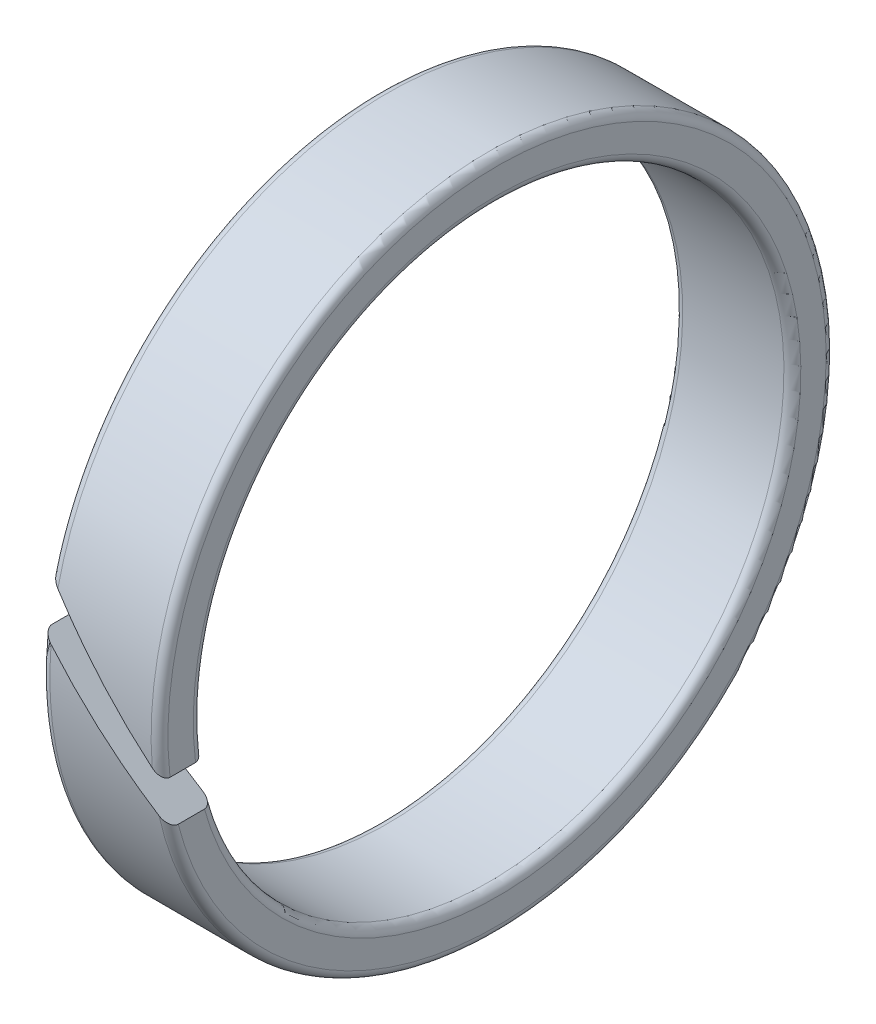
ISO-10303-21;
HEADER;
FILE_DESCRIPTION(('STEP AP214'),'2;1');
FILE_NAME('part.step','',(''),(''),'','','');
FILE_SCHEMA(('AUTOMOTIVE_DESIGN { 1 0 10303 214 1 1 1 1 }'));
ENDSEC;
DATA;
#1=APPLICATION_CONTEXT('core data for automotive mechanical design processes');
#2=APPLICATION_PROTOCOL_DEFINITION('international standard','automotive_design',2000,#1);
#3=PRODUCT_CONTEXT('',#1,'mechanical');
#4=PRODUCT('Part','Part','',(#3));
#5=PRODUCT_RELATED_PRODUCT_CATEGORY('part','',(#4));
#6=PRODUCT_DEFINITION_FORMATION('','',#4);
#7=PRODUCT_DEFINITION_CONTEXT('part definition',#1,'design');
#8=PRODUCT_DEFINITION('design','',#6,#7);
#9=PRODUCT_DEFINITION_SHAPE('','',#8);
#10=(LENGTH_UNIT() NAMED_UNIT(*) SI_UNIT(.MILLI.,.METRE.));
#11=(NAMED_UNIT(*) PLANE_ANGLE_UNIT() SI_UNIT($,.RADIAN.));
#12=(NAMED_UNIT(*) SI_UNIT($,.STERADIAN.) SOLID_ANGLE_UNIT());
#13=UNCERTAINTY_MEASURE_WITH_UNIT(LENGTH_MEASURE(1.E-05),#10,'distance_accuracy_value','');
#14=(GEOMETRIC_REPRESENTATION_CONTEXT(3) GLOBAL_UNCERTAINTY_ASSIGNED_CONTEXT((#13)) GLOBAL_UNIT_ASSIGNED_CONTEXT((#10,
#11,#12)) REPRESENTATION_CONTEXT('',''));
#15=CARTESIAN_POINT('',(0.,0.,0.));
#16=DIRECTION('',(0.,0.,1.));
#17=DIRECTION('',(1.,0.,0.));
#18=AXIS2_PLACEMENT_3D('',#15,#16,#17);
#19=CARTESIAN_POINT('',(-2.8,16.,0.));
#20=DIRECTION('',(1.,0.,0.));
#21=DIRECTION('',(0.,0.,-1.));
#22=AXIS2_PLACEMENT_3D('',#19,#20,#21);
#23=PLANE('',#22);
#24=DIRECTION('',(0.,0.,-1.));
#25=VECTOR('',#24,1.);
#26=CARTESIAN_POINT('',(-2.8,3.86066017177978,16.));
#27=LINE('',#26,#25);
#28=CARTESIAN_POINT('',(-2.8,3.86066017177978,15.1147379414277));
#29=VERTEX_POINT('',#28);
#30=CARTESIAN_POINT('',(-2.8,3.86066017177978,13.8728260652988));
#31=VERTEX_POINT('',#30);
#32=EDGE_CURVE('E107',#29,#31,#27,.T.);
#33=ORIENTED_EDGE('',*,*,#32,.F.);
#34=CARTESIAN_POINT('',(-2.8,0.,0.));
#35=DIRECTION('',(1.,0.,0.));
#36=DIRECTION('',(0.,0.,-1.));
#37=AXIS2_PLACEMENT_3D('',#34,#35,#36);
#38=CIRCLE('',#37,15.6);
#39=CARTESIAN_POINT('',(-2.8,1.73933982822015,15.5027319193092));
#40=VERTEX_POINT('',#39);
#41=EDGE_CURVE('E120',#29,#40,#38,.F.);
#42=ORIENTED_EDGE('',*,*,#41,.T.);
#43=DIRECTION('',(0.,0.,1.));
#44=VECTOR('',#43,1.);
#45=CARTESIAN_POINT('',(-2.8,1.73933982822015,0.));
#46=LINE('',#45,#44);
#47=CARTESIAN_POINT('',(-2.8,1.73933982822015,14.2945687924459));
#48=VERTEX_POINT('',#47);
#49=EDGE_CURVE('E124',#48,#40,#46,.T.);
#50=ORIENTED_EDGE('',*,*,#49,.F.);
#51=CARTESIAN_POINT('',(-2.8,0.,0.));
#52=DIRECTION('',(1.,0.,0.));
#53=DIRECTION('',(0.,0.,-1.));
#54=AXIS2_PLACEMENT_3D('',#51,#52,#53);
#55=CIRCLE('',#54,14.4);
#56=EDGE_CURVE('E123',#48,#31,#55,.T.);
#57=ORIENTED_EDGE('',*,*,#56,.T.);
#58=EDGE_LOOP('',(#33,#42,#50,#57));
#59=FACE_BOUND('',#58,.T.);
#60=ADVANCED_FACE('F36',(#59),#23,.F.);
#61=CARTESIAN_POINT('',(0.,0.,0.));
#62=DIRECTION('',(-1.,0.,0.));
#63=DIRECTION('',(0.,0.,1.));
#64=AXIS2_PLACEMENT_3D('',#61,#62,#63);
#65=CYLINDRICAL_SURFACE('',#64,14.);
#66=CARTESIAN_POINT('',(1.06066017177983,0.,0.));
#67=DIRECTION('',(-0.707106781186543,-0.707106781186552,0.));
#68=DIRECTION('',(-0.707106781186552,0.707106781186543,0.));
#69=AXIS2_PLACEMENT_3D('',#66,#67,#68);
#70=ELLIPSE('',#69,19.7989898732234,14.);
#71=CARTESIAN_POINT('',(-2.4,3.46066017177979,13.5655383665912));
#72=VERTEX_POINT('',#71);
#73=CARTESIAN_POINT('',(2.4,-1.33933982822016,13.9357873413935));
#74=VERTEX_POINT('',#73);
#75=EDGE_CURVE('E203',#72,#74,#70,.F.);
#76=ORIENTED_EDGE('',*,*,#75,.F.);
#77=CARTESIAN_POINT('',(-2.4,0.,0.));
#78=DIRECTION('',(1.,0.,0.));
#79=DIRECTION('',(0.,0.,-1.));
#80=AXIS2_PLACEMENT_3D('',#77,#78,#79);
#81=CIRCLE('',#80,14.);
#82=CARTESIAN_POINT('',(-2.4,1.33933982822016,13.9357873413935));
#83=VERTEX_POINT('',#82);
#84=EDGE_CURVE('E11',#72,#83,#81,.F.);
#85=ORIENTED_EDGE('',*,*,#84,.T.);
#86=CARTESIAN_POINT('',(-1.06066017177983,0.,0.));
#87=DIRECTION('',(0.707106781186543,0.707106781186552,0.));
#88=DIRECTION('',(-0.707106781186552,0.707106781186543,0.));
#89=AXIS2_PLACEMENT_3D('',#86,#87,#88);
#90=ELLIPSE('',#89,19.7989898732234,14.);
#91=CARTESIAN_POINT('',(2.4,-3.46066017177979,13.5655383665912));
#92=VERTEX_POINT('',#91);
#93=EDGE_CURVE('E206',#92,#83,#90,.F.);
#94=ORIENTED_EDGE('',*,*,#93,.F.);
#95=CARTESIAN_POINT('',(2.4,0.,0.));
#96=DIRECTION('',(-1.,0.,0.));
#97=DIRECTION('',(0.,0.,1.));
#98=AXIS2_PLACEMENT_3D('',#95,#96,#97);
#99=CIRCLE('',#98,14.);
#100=EDGE_CURVE('E45',#92,#74,#99,.F.);
#101=ORIENTED_EDGE('',*,*,#100,.T.);
#102=EDGE_LOOP('',(#76,#85,#94,#101));
#103=FACE_BOUND('',#102,.T.);
#104=ADVANCED_FACE('F202',(#103),#65,.F.);
#105=CARTESIAN_POINT('',(2.8,16.,0.));
#106=DIRECTION('',(-1.,0.,0.));
#107=DIRECTION('',(0.,0.,1.));
#108=AXIS2_PLACEMENT_3D('',#105,#106,#107);
#109=PLANE('',#108);
#110=DIRECTION('',(0.,0.,-1.));
#111=VECTOR('',#110,1.);
#112=CARTESIAN_POINT('',(2.8,-3.86066017177978,16.));
#113=LINE('',#112,#111);
#114=CARTESIAN_POINT('',(2.8,-3.86066017177978,15.1147379414277));
#115=VERTEX_POINT('',#114);
#116=CARTESIAN_POINT('',(2.8,-3.86066017177978,13.8728260652988));
#117=VERTEX_POINT('',#116);
#118=EDGE_CURVE('E125',#115,#117,#113,.T.);
#119=ORIENTED_EDGE('',*,*,#118,.F.);
#120=CARTESIAN_POINT('',(2.8,0.,0.));
#121=DIRECTION('',(-1.,0.,0.));
#122=DIRECTION('',(0.,0.,1.));
#123=AXIS2_PLACEMENT_3D('',#120,#121,#122);
#124=CIRCLE('',#123,15.6);
#125=CARTESIAN_POINT('',(2.8,-1.73933982822015,15.5027319193092));
#126=VERTEX_POINT('',#125);
#127=EDGE_CURVE('E52',#115,#126,#124,.F.);
#128=ORIENTED_EDGE('',*,*,#127,.T.);
#129=DIRECTION('',(0.,0.,1.));
#130=VECTOR('',#129,1.);
#131=CARTESIAN_POINT('',(2.8,-1.73933982822015,0.));
#132=LINE('',#131,#130);
#133=CARTESIAN_POINT('',(2.8,-1.73933982822015,14.2945687924459));
#134=VERTEX_POINT('',#133);
#135=EDGE_CURVE('E209',#134,#126,#132,.T.);
#136=ORIENTED_EDGE('',*,*,#135,.F.);
#137=CARTESIAN_POINT('',(2.8,0.,0.));
#138=DIRECTION('',(-1.,0.,0.));
#139=DIRECTION('',(0.,0.,1.));
#140=AXIS2_PLACEMENT_3D('',#137,#138,#139);
#141=CIRCLE('',#140,14.4);
#142=EDGE_CURVE('E114',#134,#117,#141,.T.);
#143=ORIENTED_EDGE('',*,*,#142,.T.);
#144=EDGE_LOOP('',(#119,#128,#136,#143));
#145=FACE_BOUND('',#144,.T.);
#146=ADVANCED_FACE('F230',(#145),#109,.F.);
#147=CARTESIAN_POINT('',(0.,0.,0.));
#148=DIRECTION('',(-1.,0.,0.));
#149=DIRECTION('',(0.,0.,1.));
#150=AXIS2_PLACEMENT_3D('',#147,#148,#149);
#151=CYLINDRICAL_SURFACE('',#150,16.);
#152=CARTESIAN_POINT('',(-1.06066017177983,0.,0.));
#153=DIRECTION('',(0.707106781186543,0.707106781186552,0.));
#154=DIRECTION('',(-0.707106781186552,0.707106781186543,0.));
#155=AXIS2_PLACEMENT_3D('',#152,#153,#154);
#156=ELLIPSE('',#155,22.6274169979697,16.);
#157=CARTESIAN_POINT('',(-2.4,1.33933982822015,15.9438442298131));
#158=VERTEX_POINT('',#157);
#159=CARTESIAN_POINT('',(2.4,-3.46066017177979,15.621262150526));
#160=VERTEX_POINT('',#159);
#161=EDGE_CURVE('E208',#158,#160,#156,.T.);
#162=ORIENTED_EDGE('',*,*,#161,.F.);
#163=CARTESIAN_POINT('',(-2.4,0.,0.));
#164=DIRECTION('',(1.,0.,0.));
#165=DIRECTION('',(0.,0.,-1.));
#166=AXIS2_PLACEMENT_3D('',#163,#164,#165);
#167=CIRCLE('',#166,16.);
#168=CARTESIAN_POINT('',(-2.4,3.46066017177979,15.621262150526));
#169=VERTEX_POINT('',#168);
#170=EDGE_CURVE('E212',#158,#169,#167,.T.);
#171=ORIENTED_EDGE('',*,*,#170,.T.);
#172=CARTESIAN_POINT('',(1.06066017177983,0.,0.));
#173=DIRECTION('',(-0.707106781186543,-0.707106781186552,0.));
#174=DIRECTION('',(-0.707106781186552,0.707106781186543,0.));
#175=AXIS2_PLACEMENT_3D('',#172,#173,#174);
#176=ELLIPSE('',#175,22.6274169979697,16.);
#177=CARTESIAN_POINT('',(2.40000000000001,-1.33933982822016,15.9438442298131));
#178=VERTEX_POINT('',#177);
#179=EDGE_CURVE('E110',#178,#169,#176,.T.);
#180=ORIENTED_EDGE('',*,*,#179,.F.);
#181=CARTESIAN_POINT('',(2.4,0.,0.));
#182=DIRECTION('',(-1.,0.,0.));
#183=DIRECTION('',(0.,0.,1.));
#184=AXIS2_PLACEMENT_3D('',#181,#182,#183);
#185=CIRCLE('',#184,16.);
#186=EDGE_CURVE('E213',#178,#160,#185,.T.);
#187=ORIENTED_EDGE('',*,*,#186,.T.);
#188=EDGE_LOOP('',(#162,#171,#180,#187));
#189=FACE_BOUND('',#188,.T.);
#190=ADVANCED_FACE('F150',(#189),#151,.T.);
#191=CARTESIAN_POINT('',(2.8,-3.86066017177978,16.));
#192=DIRECTION('',(0.707106781186543,0.707106781186552,0.));
#193=DIRECTION('',(-0.707106781186552,0.707106781186543,0.));
#194=AXIS2_PLACEMENT_3D('',#191,#192,#193);
#195=PLANE('',#194);
#196=ORIENTED_EDGE('',*,*,#49,.T.);
#197=CARTESIAN_POINT('',(-2.8,1.73933982822015,15.5027319193092));
#198=CARTESIAN_POINT('',(-2.80002414296971,1.73936397118987,15.5219899710305));
#199=CARTESIAN_POINT('',(-2.79862874625771,1.73796857447786,15.541167137704));
#200=CARTESIAN_POINT('',(-2.7933847811156,1.73272460933575,15.5786529139178));
#201=CARTESIAN_POINT('',(-2.78956071031916,1.72890053853931,15.5969682572768));
#202=CARTESIAN_POINT('',(-2.77985488547629,1.71919471369644,15.6323407397394));
#203=CARTESIAN_POINT('',(-2.77398317316741,1.71332300138756,15.6494035358755));
#204=CARTESIAN_POINT('',(-2.7605506434259,1.69989047164605,15.6821841456752));
#205=CARTESIAN_POINT('',(-2.75298507381375,1.6923249020339,15.6978979998073));
#206=CARTESIAN_POINT('',(-2.73234106094019,1.67168088916034,15.7353963129682));
#207=CARTESIAN_POINT('',(-2.71840772293209,1.65774755115225,15.7562403971696));
#208=CARTESIAN_POINT('',(-2.68837525125935,1.62771507947951,15.794517196072));
#209=CARTESIAN_POINT('',(-2.67227206136123,1.61161188958138,15.8119433679308));
#210=CARTESIAN_POINT('',(-2.63268120897487,1.57202103719502,15.8489441649369));
#211=CARTESIAN_POINT('',(-2.60856652840388,1.54790635662404,15.8671754362288));
#212=CARTESIAN_POINT('',(-2.55858679663128,1.49792662485144,15.8979051237143));
#213=CARTESIAN_POINT('',(-2.53272036059367,1.47206018881382,15.9103989420472));
#214=CARTESIAN_POINT('',(-2.48891756796899,1.42825739618915,15.926507797815));
#215=CARTESIAN_POINT('',(-2.4712610226446,1.41060085086476,15.9316967463014));
#216=CARTESIAN_POINT('',(-2.43575405478125,1.37509388300141,15.9396038304944));
#217=CARTESIAN_POINT('',(-2.41790485250253,1.35724468072268,15.9423329128119));
#218=CARTESIAN_POINT('',(-2.4,1.33933982822016,15.9438442298131));
#219=B_SPLINE_CURVE_WITH_KNOTS('',3,(#197,#198,#199,#200,#201,#202,#203,#204,#205,#206,#207,
#208,#209,#210,#211,#212,#213,#214,#215,#216,#217,#218),.UNSPECIFIED.,.F.,.F.,(4,2,2,2,2,2,2,2,
2,2,4),(0.,0.0575512009551341,0.114530917428404,0.171235043318839,0.228100293853444,
0.313674397754344,0.399410749050616,0.514816437488986,0.630314448650277,0.706712662009292,
0.782769193913545),.UNSPECIFIED.);
#220=EDGE_CURVE('E128',#40,#158,#219,.T.);
#221=ORIENTED_EDGE('',*,*,#220,.T.);
#222=ORIENTED_EDGE('',*,*,#161,.T.);
#223=CARTESIAN_POINT('',(2.4,-3.46066017177979,15.621262150526));
#224=CARTESIAN_POINT('',(2.41589059644092,-3.47655076822071,15.6177359152247));
#225=CARTESIAN_POINT('',(2.43166314850669,-3.49232332028648,15.6132524468141));
#226=CARTESIAN_POINT('',(2.46289215481385,-3.52355232659364,15.6024268564805));
#227=CARTESIAN_POINT('',(2.47834849682489,-3.53900866860468,15.596084086484));
#228=CARTESIAN_POINT('',(2.52429020805699,-3.58495037983678,15.5742681139684));
#229=CARTESIAN_POINT('',(2.55415476302579,-3.61481493480557,15.5560509763566));
#230=CARTESIAN_POINT('',(2.60642023886314,-3.66708041064293,15.5162384243361));
#231=CARTESIAN_POINT('',(2.62923454720759,-3.68989471898737,15.4957157929454));
#232=CARTESIAN_POINT('',(2.67223829388695,-3.73289846566674,15.4498120435566));
#233=CARTESIAN_POINT('',(2.69243522197706,-3.75309539375685,15.4244453266061));
#234=CARTESIAN_POINT('',(2.72350459933316,-3.78416477111294,15.3773570245568));
#235=CARTESIAN_POINT('',(2.73533763686975,-3.79599780864953,15.3569012894369));
#236=CARTESIAN_POINT('',(2.756688864278,-3.81734903605779,15.3136652132558));
#237=CARTESIAN_POINT('',(2.76620881176749,-3.82686898354728,15.2908866560112));
#238=CARTESIAN_POINT('',(2.78028359163266,-3.84094376341244,15.2489336340058));
#239=CARTESIAN_POINT('',(2.78548088921272,-3.84614106099251,15.2301919263675));
#240=CARTESIAN_POINT('',(2.7936724018974,-3.85433257367719,15.1917973123611));
#241=CARTESIAN_POINT('',(2.79667425650812,-3.8573344282879,15.1721478211109));
#242=CARTESIAN_POINT('',(2.79944681338913,-3.86010698516892,15.1398314862531));
#243=CARTESIAN_POINT('',(2.80000483620855,-3.86066500798834,15.1272919642174));
#244=CARTESIAN_POINT('',(2.80000000000006,-3.86066017177984,15.1147379414277));
#245=B_SPLINE_CURVE_WITH_KNOTS('',3,(#223,#224,#225,#226,#227,#228,#229,#230,#231,#232,#233,
#234,#235,#236,#237,#238,#239,#240,#241,#242,#243,#244),.UNSPECIFIED.,.F.,.F.,(4,2,2,2,2,2,2,2,
2,2,4),(0.,0.0681907302340294,0.136405257179055,0.273655696419072,0.387977291769093,
0.501964166012714,0.581013331533494,0.660002241811299,0.720188926877886,0.780165170093383,
0.817785637817443),.UNSPECIFIED.);
#246=EDGE_CURVE('E158',#160,#115,#245,.T.);
#247=ORIENTED_EDGE('',*,*,#246,.T.);
#248=ORIENTED_EDGE('',*,*,#118,.T.);
#249=CARTESIAN_POINT('',(2.8,-3.86066017177978,13.8728260652988));
#250=CARTESIAN_POINT('',(2.80002392432252,-3.86068409610231,13.8568823863019));
#251=CARTESIAN_POINT('',(2.7991168064583,-3.85977697823808,13.8409172741005));
#252=CARTESIAN_POINT('',(2.79543045173403,-3.85609062351381,13.8094562623489));
#253=CARTESIAN_POINT('',(2.79265441458072,-3.8533145863605,13.7939596080728));
#254=CARTESIAN_POINT('',(2.78520975065857,-3.84586992243835,13.7638469432441));
#255=CARTESIAN_POINT('',(2.780535748189,-3.84119591996878,13.7492335706535));
#256=CARTESIAN_POINT('',(2.76947670562236,-3.83013687740214,13.7213853839891));
#257=CARTESIAN_POINT('',(2.76309264798852,-3.8237528197683,13.7081497843995));
#258=CARTESIAN_POINT('',(2.74905835347251,-3.80971852525229,13.68362401776));
#259=CARTESIAN_POINT('',(2.74144131138645,-3.80210148316623,13.6722955151361));
#260=CARTESIAN_POINT('',(2.72513019259526,-3.78579036437504,13.6513140514524));
#261=CARTESIAN_POINT('',(2.71643515314224,-3.77709532492202,13.6416626068967));
#262=CARTESIAN_POINT('',(2.69374502396226,-3.75440519574205,13.6196749088397));
#263=CARTESIAN_POINT('',(2.67925219234328,-3.73991236412307,13.6083647023757));
#264=CARTESIAN_POINT('',(2.64917634753906,-3.70983651931884,13.5891606726491));
#265=CARTESIAN_POINT('',(2.63359087413164,-3.69425104591142,13.5812748668203));
#266=CARTESIAN_POINT('',(2.5946835036213,-3.65534367540108,13.5656638066296));
#267=CARTESIAN_POINT('',(2.57103078903491,-3.63169096081469,13.5596013397699));
#268=CARTESIAN_POINT('',(2.52335472145976,-3.58401489323955,13.5527615854767));
#269=CARTESIAN_POINT('',(2.49933083034557,-3.55999100212535,13.5519928717117));
#270=CARTESIAN_POINT('',(2.46271563147753,-3.52337580325732,13.5542846131507));
#271=CARTESIAN_POINT('',(2.45005958599294,-3.51071975777272,13.5557146946352));
#272=CARTESIAN_POINT('',(2.42491280270332,-3.48557297448311,13.5597617713325));
#273=CARTESIAN_POINT('',(2.4124215384067,-3.47308171018649,13.5623721885705));
#274=CARTESIAN_POINT('',(2.4,-3.46066017177979,13.5655383665912));
#275=B_SPLINE_CURVE_WITH_KNOTS('',3,(#249,#250,#251,#252,#253,#254,#255,#256,#257,#258,#259,
#260,#261,#262,#263,#264,#265,#266,#267,#268,#269,#270,#271,#272,#273,#274),.UNSPECIFIED.,.F.,
.F.,(4,2,2,2,2,2,2,2,2,2,2,2,4),(0.,0.0478086501669945,0.0955356563865295,0.143398795672032,
0.191234495322909,0.23794868359537,0.284704896473159,0.354538483145073,0.424534698713889,
0.525968043628473,0.627565629634104,0.681396874916114,0.734931748925863),.UNSPECIFIED.);
#276=EDGE_CURVE('E129',#117,#92,#275,.T.);
#277=ORIENTED_EDGE('',*,*,#276,.T.);
#278=ORIENTED_EDGE('',*,*,#93,.T.);
#279=CARTESIAN_POINT('',(-2.4,1.33933982822016,13.9357873413935));
#280=CARTESIAN_POINT('',(-2.41526986660554,1.3546096948257,13.9343264645457));
#281=CARTESIAN_POINT('',(-2.43056962609017,1.36990945431033,13.933702521037));
#282=CARTESIAN_POINT('',(-2.46118622965532,1.40052605787548,13.9342066223702));
#283=CARTESIAN_POINT('',(-2.47650304169247,1.41584286991262,13.9353383657912));
#284=CARTESIAN_POINT('',(-2.52262069902677,1.46196052724692,13.9415297106436));
#285=CARTESIAN_POINT('',(-2.55328191548677,1.49262174370692,13.9494180283158));
#286=CARTESIAN_POINT('',(-2.60162731597389,1.54096714419405,13.9691787401062));
#287=CARTESIAN_POINT('',(-2.6198560268563,1.55919585507645,13.9784378267383));
#288=CARTESIAN_POINT('',(-2.65511625822969,1.59445608644985,14.000651686557));
#289=CARTESIAN_POINT('',(-2.67215182749463,1.61149165571478,14.0135931230059));
#290=CARTESIAN_POINT('',(-2.70063159573839,1.63997142395854,14.040088075768));
#291=CARTESIAN_POINT('',(-2.71245946279035,1.6517992910105,14.0528128133185));
#292=CARTESIAN_POINT('',(-2.734535517609,1.67387534582915,14.0807759705245));
#293=CARTESIAN_POINT('',(-2.74478555695425,1.6841253851744,14.0960113997174));
#294=CARTESIAN_POINT('',(-2.76141400396538,1.70075383218553,14.1258319728541));
#295=CARTESIAN_POINT('',(-2.76815795740867,1.70749778562882,14.140007841591));
#296=CARTESIAN_POINT('',(-2.77988309325252,1.71922292147267,14.1697446864831));
#297=CARTESIAN_POINT('',(-2.78486662980065,1.72420645802081,14.18530377776));
#298=CARTESIAN_POINT('',(-2.79250819319024,1.73184802141039,14.2162752821795));
#299=CARTESIAN_POINT('',(-2.79530763856933,1.73464746678948,14.2316178365009));
#300=CARTESIAN_POINT('',(-2.79907001347424,1.73840984169439,14.2628254702983));
#301=CARTESIAN_POINT('',(-2.80002358309228,1.73936341131243,14.2786928000331));
#302=CARTESIAN_POINT('',(-2.8,1.73933982822015,14.2945687924459));
#303=B_SPLINE_CURVE_WITH_KNOTS('',3,(#279,#280,#281,#282,#283,#284,#285,#286,#287,#288,#289,
#290,#291,#292,#293,#294,#295,#296,#297,#298,#299,#300,#301,#302),.UNSPECIFIED.,.F.,.F.,(4,2,2,
2,2,2,2,2,2,2,2,4),(0.,0.0648842750326391,0.129905422823421,0.261238782306471,0.343189792804677,
0.424847690736322,0.487682045465029,0.550442092625624,0.601489526114392,0.652468434798698,
0.699782678236189,0.747336216600449),.UNSPECIFIED.);
#304=EDGE_CURVE('E131',#83,#48,#303,.T.);
#305=ORIENTED_EDGE('',*,*,#304,.T.);
#306=EDGE_LOOP('',(#196,#221,#222,#247,#248,#277,#278,#305));
#307=FACE_BOUND('',#306,.T.);
#308=ADVANCED_FACE('F146',(#307),#195,.T.);
#309=CARTESIAN_POINT('',(3.86066017177982,-2.79999999999996,16.));
#310=DIRECTION('',(-0.707106781186543,-0.707106781186552,0.));
#311=DIRECTION('',(0.707106781186552,-0.707106781186543,0.));
#312=AXIS2_PLACEMENT_3D('',#309,#310,#311);
#313=PLANE('',#312);
#314=ORIENTED_EDGE('',*,*,#179,.T.);
#315=CARTESIAN_POINT('',(-2.4,3.46066017177979,15.621262150526));
#316=CARTESIAN_POINT('',(-2.41589059644092,3.47655076822071,15.6177359152247));
#317=CARTESIAN_POINT('',(-2.43166314850669,3.49232332028648,15.6132524468141));
#318=CARTESIAN_POINT('',(-2.46289215481385,3.52355232659364,15.6024268564805));
#319=CARTESIAN_POINT('',(-2.47834849682489,3.53900866860467,15.596084086484));
#320=CARTESIAN_POINT('',(-2.52429020805699,3.58495037983678,15.5742681139684));
#321=CARTESIAN_POINT('',(-2.55415476302578,3.61481493480557,15.5560509763566));
#322=CARTESIAN_POINT('',(-2.60642023886314,3.66708041064293,15.5162384243361));
#323=CARTESIAN_POINT('',(-2.62923454720759,3.68989471898737,15.4957157929454));
#324=CARTESIAN_POINT('',(-2.67223829388695,3.73289846566674,15.4498120435566));
#325=CARTESIAN_POINT('',(-2.69243522197706,3.75309539375685,15.4244453266061));
#326=CARTESIAN_POINT('',(-2.72350459933316,3.78416477111294,15.3773570245568));
#327=CARTESIAN_POINT('',(-2.73533763686975,3.79599780864953,15.3569012894369));
#328=CARTESIAN_POINT('',(-2.756688864278,3.81734903605778,15.3136652132558));
#329=CARTESIAN_POINT('',(-2.76620881176749,3.82686898354727,15.2908866560112));
#330=CARTESIAN_POINT('',(-2.78028359163266,3.84094376341244,15.2489336340058));
#331=CARTESIAN_POINT('',(-2.78548088921272,3.8461410609925,15.2301919263675));
#332=CARTESIAN_POINT('',(-2.7936724018974,3.85433257367719,15.1917973123611));
#333=CARTESIAN_POINT('',(-2.79667425650812,3.8573344282879,15.1721478211109));
#334=CARTESIAN_POINT('',(-2.79944681338914,3.86010698516892,15.1398314862531));
#335=CARTESIAN_POINT('',(-2.80000483620855,3.86066500798834,15.1272919642174));
#336=CARTESIAN_POINT('',(-2.80000000000006,3.86066017177984,15.1147379414277));
#337=B_SPLINE_CURVE_WITH_KNOTS('',3,(#315,#316,#317,#318,#319,#320,#321,#322,#323,#324,#325,
#326,#327,#328,#329,#330,#331,#332,#333,#334,#335,#336),.UNSPECIFIED.,.F.,.F.,(4,2,2,2,2,2,2,2,
2,2,4),(0.,0.0681907302340282,0.136405257179052,0.27365569641907,0.38797729176909,
0.501964166012709,0.58101333153349,0.660002241811296,0.720188926877883,0.78016517009338,
0.817785637817443),.UNSPECIFIED.);
#338=EDGE_CURVE('E104',#169,#29,#337,.T.);
#339=ORIENTED_EDGE('',*,*,#338,.T.);
#340=ORIENTED_EDGE('',*,*,#32,.T.);
#341=CARTESIAN_POINT('',(-2.8,3.86066017177978,13.8728260652988));
#342=CARTESIAN_POINT('',(-2.80002392432252,3.86068409610231,13.8568823863019));
#343=CARTESIAN_POINT('',(-2.7991168064583,3.85977697823808,13.8409172741005));
#344=CARTESIAN_POINT('',(-2.79543045173403,3.85609062351381,13.8094562623489));
#345=CARTESIAN_POINT('',(-2.79265441458072,3.8533145863605,13.7939596080728));
#346=CARTESIAN_POINT('',(-2.78520975065857,3.84586992243835,13.7638469432441));
#347=CARTESIAN_POINT('',(-2.780535748189,3.84119591996878,13.7492335706535));
#348=CARTESIAN_POINT('',(-2.76947670562236,3.83013687740214,13.7213853839891));
#349=CARTESIAN_POINT('',(-2.76309264798852,3.8237528197683,13.7081497843995));
#350=CARTESIAN_POINT('',(-2.74905835347251,3.80971852525229,13.68362401776));
#351=CARTESIAN_POINT('',(-2.74144131138645,3.80210148316623,13.6722955151361));
#352=CARTESIAN_POINT('',(-2.72513019259526,3.78579036437504,13.6513140514524));
#353=CARTESIAN_POINT('',(-2.71643515314224,3.77709532492202,13.6416626068967));
#354=CARTESIAN_POINT('',(-2.69374502396226,3.75440519574205,13.6196749088397));
#355=CARTESIAN_POINT('',(-2.67925219234328,3.73991236412307,13.6083647023757));
#356=CARTESIAN_POINT('',(-2.64917634753906,3.70983651931884,13.5891606726491));
#357=CARTESIAN_POINT('',(-2.63359087413164,3.69425104591142,13.5812748668203));
#358=CARTESIAN_POINT('',(-2.5946835036213,3.65534367540109,13.5656638066296));
#359=CARTESIAN_POINT('',(-2.57103078903491,3.6316909608147,13.5596013397699));
#360=CARTESIAN_POINT('',(-2.52335472145977,3.58401489323955,13.5527615854767));
#361=CARTESIAN_POINT('',(-2.49933083034557,3.55999100212536,13.5519928717117));
#362=CARTESIAN_POINT('',(-2.46271563147754,3.52337580325732,13.5542846131507));
#363=CARTESIAN_POINT('',(-2.45005958599294,3.51071975777272,13.5557146946352));
#364=CARTESIAN_POINT('',(-2.42491280270332,3.48557297448311,13.5597617713325));
#365=CARTESIAN_POINT('',(-2.41242153840671,3.47308171018649,13.5623721885706));
#366=CARTESIAN_POINT('',(-2.4,3.46066017177979,13.5655383665912));
#367=B_SPLINE_CURVE_WITH_KNOTS('',3,(#341,#342,#343,#344,#345,#346,#347,#348,#349,#350,#351,
#352,#353,#354,#355,#356,#357,#358,#359,#360,#361,#362,#363,#364,#365,#366),.UNSPECIFIED.,.F.,
.F.,(4,2,2,2,2,2,2,2,2,2,2,2,4),(0.,0.0478086501669946,0.0955356563865293,0.143398795672031,
0.19123449532291,0.23794868359537,0.284704896473159,0.354538483145072,0.424534698713887,
0.525968043628469,0.627565629634098,0.681396874916112,0.734931748925864),.UNSPECIFIED.);
#368=EDGE_CURVE('E185',#31,#72,#367,.T.);
#369=ORIENTED_EDGE('',*,*,#368,.T.);
#370=ORIENTED_EDGE('',*,*,#75,.T.);
#371=CARTESIAN_POINT('',(2.4,-1.33933982822016,13.9357873413935));
#372=CARTESIAN_POINT('',(2.41526986660554,-1.3546096948257,13.9343264645457));
#373=CARTESIAN_POINT('',(2.43056962609017,-1.36990945431033,13.933702521037));
#374=CARTESIAN_POINT('',(2.46118622965532,-1.40052605787548,13.9342066223702));
#375=CARTESIAN_POINT('',(2.47650304169247,-1.41584286991263,13.9353383657912));
#376=CARTESIAN_POINT('',(2.52262069902677,-1.46196052724692,13.9415297106436));
#377=CARTESIAN_POINT('',(2.55328191548677,-1.49262174370692,13.9494180283158));
#378=CARTESIAN_POINT('',(2.60162731597389,-1.54096714419405,13.9691787401062));
#379=CARTESIAN_POINT('',(2.61985602685629,-1.55919585507645,13.9784378267383));
#380=CARTESIAN_POINT('',(2.65511625822969,-1.59445608644985,14.000651686557));
#381=CARTESIAN_POINT('',(2.67215182749463,-1.61149165571478,14.0135931230059));
#382=CARTESIAN_POINT('',(2.70063159573838,-1.63997142395854,14.040088075768));
#383=CARTESIAN_POINT('',(2.71245946279034,-1.6517992910105,14.0528128133185));
#384=CARTESIAN_POINT('',(2.734535517609,-1.67387534582915,14.0807759705245));
#385=CARTESIAN_POINT('',(2.74478555695425,-1.6841253851744,14.0960113997174));
#386=CARTESIAN_POINT('',(2.76141400396538,-1.70075383218553,14.1258319728541));
#387=CARTESIAN_POINT('',(2.76815795740867,-1.70749778562882,14.140007841591));
#388=CARTESIAN_POINT('',(2.77988309325252,-1.71922292147267,14.1697446864831));
#389=CARTESIAN_POINT('',(2.78486662980065,-1.72420645802081,14.18530377776));
#390=CARTESIAN_POINT('',(2.79250819319024,-1.73184802141039,14.2162752821795));
#391=CARTESIAN_POINT('',(2.79530763856933,-1.73464746678948,14.2316178365009));
#392=CARTESIAN_POINT('',(2.79907001347424,-1.73840984169439,14.2628254702983));
#393=CARTESIAN_POINT('',(2.80002358309228,-1.73936341131243,14.2786928000331));
#394=CARTESIAN_POINT('',(2.8,-1.73933982822015,14.2945687924459));
#395=B_SPLINE_CURVE_WITH_KNOTS('',3,(#371,#372,#373,#374,#375,#376,#377,#378,#379,#380,#381,
#382,#383,#384,#385,#386,#387,#388,#389,#390,#391,#392,#393,#394),.UNSPECIFIED.,.F.,.F.,(4,2,2,
2,2,2,2,2,2,2,2,4),(0.,0.0648842750326391,0.129905422823421,0.261238782306471,0.343189792804676,
0.424847690736321,0.487682045465027,0.550442092625623,0.601489526114391,0.652468434798696,
0.699782678236188,0.74733621660045),.UNSPECIFIED.);
#396=EDGE_CURVE('E59',#74,#134,#395,.T.);
#397=ORIENTED_EDGE('',*,*,#396,.T.);
#398=ORIENTED_EDGE('',*,*,#135,.T.);
#399=CARTESIAN_POINT('',(2.8,-1.73933982822015,15.5027319193092));
#400=CARTESIAN_POINT('',(2.80002414296971,-1.73936397118987,15.5219899710305));
#401=CARTESIAN_POINT('',(2.79862874625771,-1.73796857447786,15.541167137704));
#402=CARTESIAN_POINT('',(2.7933847811156,-1.73272460933576,15.5786529139178));
#403=CARTESIAN_POINT('',(2.78956071031916,-1.72890053853931,15.5969682572768));
#404=CARTESIAN_POINT('',(2.77985488547629,-1.71919471369644,15.6323407397394));
#405=CARTESIAN_POINT('',(2.77398317316741,-1.71332300138757,15.6494035358755));
#406=CARTESIAN_POINT('',(2.7605506434259,-1.69989047164605,15.6821841456752));
#407=CARTESIAN_POINT('',(2.75298507381375,-1.69232490203391,15.6978979998073));
#408=CARTESIAN_POINT('',(2.73234106094019,-1.67168088916035,15.7353963129682));
#409=CARTESIAN_POINT('',(2.7184077229321,-1.65774755115225,15.7562403971696));
#410=CARTESIAN_POINT('',(2.68837525125935,-1.62771507947951,15.794517196072));
#411=CARTESIAN_POINT('',(2.67227206136123,-1.61161188958138,15.8119433679308));
#412=CARTESIAN_POINT('',(2.63268120897487,-1.57202103719502,15.8489441649369));
#413=CARTESIAN_POINT('',(2.60856652840388,-1.54790635662404,15.8671754362288));
#414=CARTESIAN_POINT('',(2.55858679663128,-1.49792662485144,15.8979051237143));
#415=CARTESIAN_POINT('',(2.53272036059367,-1.47206018881383,15.9103989420472));
#416=CARTESIAN_POINT('',(2.48891756796899,-1.42825739618915,15.926507797815));
#417=CARTESIAN_POINT('',(2.4712610226446,-1.41060085086476,15.9316967463014));
#418=CARTESIAN_POINT('',(2.43575405478125,-1.37509388300141,15.9396038304944));
#419=CARTESIAN_POINT('',(2.41790485250253,-1.35724468072268,15.9423329128119));
#420=CARTESIAN_POINT('',(2.4,-1.33933982822016,15.9438442298131));
#421=B_SPLINE_CURVE_WITH_KNOTS('',3,(#399,#400,#401,#402,#403,#404,#405,#406,#407,#408,#409,
#410,#411,#412,#413,#414,#415,#416,#417,#418,#419,#420),.UNSPECIFIED.,.F.,.F.,(4,2,2,2,2,2,2,2,
2,2,4),(0.,0.0575512009551338,0.114530917428403,0.171235043318839,0.228100293853444,
0.31367439775434,0.399410749050616,0.514816437488986,0.630314448650275,0.706712662009292,
0.782769193913546),.UNSPECIFIED.);
#422=EDGE_CURVE('E115',#126,#178,#421,.T.);
#423=ORIENTED_EDGE('',*,*,#422,.T.);
#424=EDGE_LOOP('',(#314,#339,#340,#369,#370,#397,#398,#423));
#425=FACE_BOUND('',#424,.T.);
#426=ADVANCED_FACE('F106',(#425),#313,.T.);
#427=CARTESIAN_POINT('',(-2.4,0.,0.));
#428=DIRECTION('',(1.,0.,0.));
#429=DIRECTION('',(0.,0.,-1.));
#430=AXIS2_PLACEMENT_3D('',#427,#428,#429);
#431=TOROIDAL_SURFACE('',#430,15.6,0.4);
#432=ORIENTED_EDGE('',*,*,#338,.F.);
#433=ORIENTED_EDGE('',*,*,#170,.F.);
#434=ORIENTED_EDGE('',*,*,#220,.F.);
#435=ORIENTED_EDGE('',*,*,#41,.F.);
#436=EDGE_LOOP('',(#432,#433,#434,#435));
#437=FACE_BOUND('',#436,.T.);
#438=ADVANCED_FACE('F127',(#437),#431,.T.);
#439=CARTESIAN_POINT('',(2.4,0.,0.));
#440=DIRECTION('',(-1.,0.,0.));
#441=DIRECTION('',(0.,0.,1.));
#442=AXIS2_PLACEMENT_3D('',#439,#440,#441);
#443=TOROIDAL_SURFACE('',#442,15.6,0.4);
#444=ORIENTED_EDGE('',*,*,#422,.F.);
#445=ORIENTED_EDGE('',*,*,#127,.F.);
#446=ORIENTED_EDGE('',*,*,#246,.F.);
#447=ORIENTED_EDGE('',*,*,#186,.F.);
#448=EDGE_LOOP('',(#444,#445,#446,#447));
#449=FACE_BOUND('',#448,.T.);
#450=ADVANCED_FACE('F170',(#449),#443,.T.);
#451=CARTESIAN_POINT('',(-2.4,0.,0.));
#452=DIRECTION('',(1.,0.,0.));
#453=DIRECTION('',(0.,0.,-1.));
#454=AXIS2_PLACEMENT_3D('',#451,#452,#453);
#455=TOROIDAL_SURFACE('',#454,14.4,0.4);
#456=ORIENTED_EDGE('',*,*,#368,.F.);
#457=ORIENTED_EDGE('',*,*,#56,.F.);
#458=ORIENTED_EDGE('',*,*,#304,.F.);
#459=ORIENTED_EDGE('',*,*,#84,.F.);
#460=EDGE_LOOP('',(#456,#457,#458,#459));
#461=FACE_BOUND('',#460,.T.);
#462=ADVANCED_FACE('F173',(#461),#455,.T.);
#463=CARTESIAN_POINT('',(2.4,0.,0.));
#464=DIRECTION('',(-1.,0.,0.));
#465=DIRECTION('',(0.,0.,1.));
#466=AXIS2_PLACEMENT_3D('',#463,#464,#465);
#467=TOROIDAL_SURFACE('',#466,14.4,0.4);
#468=ORIENTED_EDGE('',*,*,#396,.F.);
#469=ORIENTED_EDGE('',*,*,#100,.F.);
#470=ORIENTED_EDGE('',*,*,#276,.F.);
#471=ORIENTED_EDGE('',*,*,#142,.F.);
#472=EDGE_LOOP('',(#468,#469,#470,#471));
#473=FACE_BOUND('',#472,.T.);
#474=ADVANCED_FACE('F38',(#473),#467,.T.);
#475=CLOSED_SHELL('',(#60,#104,#146,#190,#308,#426,#438,#450,#462,#474));
#476=MANIFOLD_SOLID_BREP('B2',#475);
#477=ADVANCED_BREP_SHAPE_REPRESENTATION('',(#18,#476),#14);
#478=SHAPE_DEFINITION_REPRESENTATION(#9,#477);
ENDSEC;
END-ISO-10303-21;
